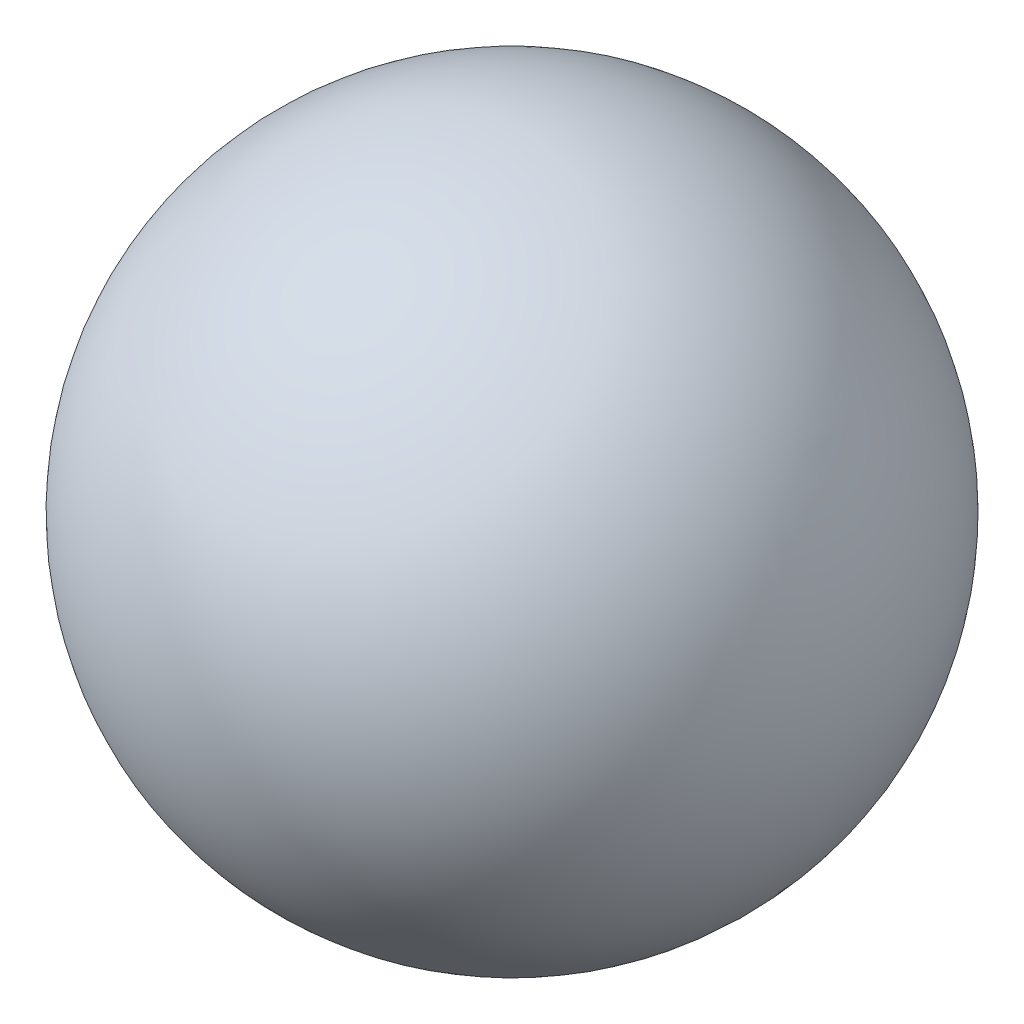
ISO-10303-21;
HEADER;
FILE_DESCRIPTION(('STEP AP214'),'2;1');
FILE_NAME('part.step','',(''),(''),'','','');
FILE_SCHEMA(('AUTOMOTIVE_DESIGN { 1 0 10303 214 1 1 1 1 }'));
ENDSEC;
DATA;
#1=APPLICATION_CONTEXT('core data for automotive mechanical design processes');
#2=APPLICATION_PROTOCOL_DEFINITION('international standard','automotive_design',2000,#1);
#3=PRODUCT_CONTEXT('',#1,'mechanical');
#4=PRODUCT('Part','Part','',(#3));
#5=PRODUCT_RELATED_PRODUCT_CATEGORY('part','',(#4));
#6=PRODUCT_DEFINITION_FORMATION('','',#4);
#7=PRODUCT_DEFINITION_CONTEXT('part definition',#1,'design');
#8=PRODUCT_DEFINITION('design','',#6,#7);
#9=PRODUCT_DEFINITION_SHAPE('','',#8);
#10=(LENGTH_UNIT() NAMED_UNIT(*) SI_UNIT(.MILLI.,.METRE.));
#11=(NAMED_UNIT(*) PLANE_ANGLE_UNIT() SI_UNIT($,.RADIAN.));
#12=(NAMED_UNIT(*) SI_UNIT($,.STERADIAN.) SOLID_ANGLE_UNIT());
#13=UNCERTAINTY_MEASURE_WITH_UNIT(LENGTH_MEASURE(1.E-05),#10,'distance_accuracy_value','');
#14=(GEOMETRIC_REPRESENTATION_CONTEXT(3) GLOBAL_UNCERTAINTY_ASSIGNED_CONTEXT((#13)) GLOBAL_UNIT_ASSIGNED_CONTEXT((#10,
#11,#12)) REPRESENTATION_CONTEXT('',''));
#15=CARTESIAN_POINT('',(0.,0.,0.));
#16=DIRECTION('',(0.,0.,1.));
#17=DIRECTION('',(1.,0.,0.));
#18=AXIS2_PLACEMENT_3D('',#15,#16,#17);
#19=CARTESIAN_POINT('',(0.,0.,0.));
#20=DIRECTION('',(0.479425538604204,0.877582561890372,0.));
#21=DIRECTION('',(0.877582561890372,-0.479425538604204,0.));
#22=AXIS2_PLACEMENT_3D('',#19,#20,#21);
#23=SPHERICAL_SURFACE('',#22,11.25);
#24=CARTESIAN_POINT('',(5.39353730929729,9.87280382126669,0.));
#25=VERTEX_POINT('',#24);
#26=VERTEX_LOOP('',#25);
#27=FACE_BOUND('',#26,.T.);
#28=CARTESIAN_POINT('',(-5.39353730929729,-9.87280382126669,0.));
#29=VERTEX_POINT('',#28);
#30=VERTEX_LOOP('',#29);
#31=FACE_BOUND('',#30,.T.);
#32=ADVANCED_FACE('F15',(#27,#31),#23,.T.);
#33=CLOSED_SHELL('',(#32));
#34=MANIFOLD_SOLID_BREP('B1',#33);
#35=ADVANCED_BREP_SHAPE_REPRESENTATION('',(#18,#34),#14);
#36=SHAPE_DEFINITION_REPRESENTATION(#9,#35);
ENDSEC;
END-ISO-10303-21;
